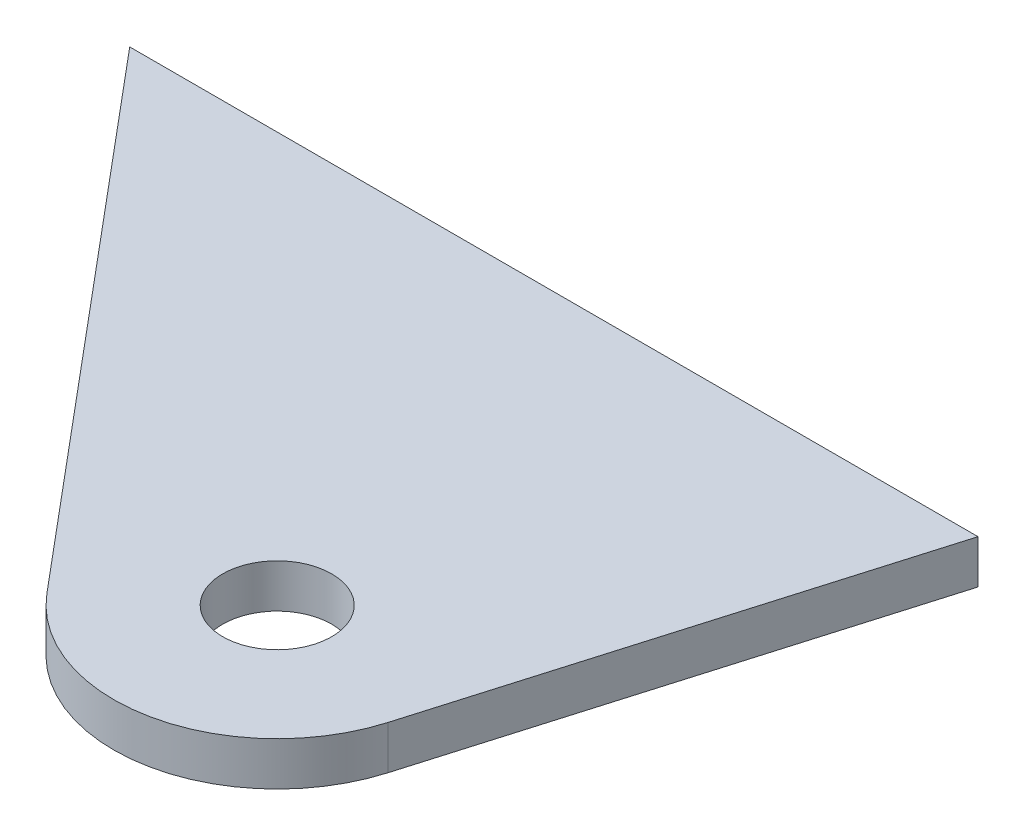
ISO-10303-21;
HEADER;
FILE_DESCRIPTION(('STEP AP214'),'2;1');
FILE_NAME('part.step','',(''),(''),'','','');
FILE_SCHEMA(('AUTOMOTIVE_DESIGN { 1 0 10303 214 1 1 1 1 }'));
ENDSEC;
DATA;
#1=APPLICATION_CONTEXT('core data for automotive mechanical design processes');
#2=APPLICATION_PROTOCOL_DEFINITION('international standard','automotive_design',2000,#1);
#3=PRODUCT_CONTEXT('',#1,'mechanical');
#4=PRODUCT('Part','Part','',(#3));
#5=PRODUCT_RELATED_PRODUCT_CATEGORY('part','',(#4));
#6=PRODUCT_DEFINITION_FORMATION('','',#4);
#7=PRODUCT_DEFINITION_CONTEXT('part definition',#1,'design');
#8=PRODUCT_DEFINITION('design','',#6,#7);
#9=PRODUCT_DEFINITION_SHAPE('','',#8);
#10=(LENGTH_UNIT() NAMED_UNIT(*) SI_UNIT(.MILLI.,.METRE.));
#11=(NAMED_UNIT(*) PLANE_ANGLE_UNIT() SI_UNIT($,.RADIAN.));
#12=(NAMED_UNIT(*) SI_UNIT($,.STERADIAN.) SOLID_ANGLE_UNIT());
#13=UNCERTAINTY_MEASURE_WITH_UNIT(LENGTH_MEASURE(1.E-05),#10,'distance_accuracy_value','');
#14=(GEOMETRIC_REPRESENTATION_CONTEXT(3) GLOBAL_UNCERTAINTY_ASSIGNED_CONTEXT((#13)) GLOBAL_UNIT_ASSIGNED_CONTEXT((#10,
#11,#12)) REPRESENTATION_CONTEXT('',''));
#15=CARTESIAN_POINT('',(0.,0.,0.));
#16=DIRECTION('',(0.,0.,1.));
#17=DIRECTION('',(1.,0.,0.));
#18=AXIS2_PLACEMENT_3D('',#15,#16,#17);
#19=CARTESIAN_POINT('',(101.6,128.27,193.675));
#20=DIRECTION('',(0.,-1.,0.));
#21=DIRECTION('',(0.,0.,-1.));
#22=AXIS2_PLACEMENT_3D('',#19,#20,#21);
#23=PLANE('',#22);
#24=DIRECTION('',(1.,0.,0.));
#25=VECTOR('',#24,1.);
#26=CARTESIAN_POINT('',(69.1316527751214,128.27,169.799));
#27=LINE('',#26,#25);
#28=CARTESIAN_POINT('',(69.1316527751214,128.27,169.799));
#29=VERTEX_POINT('',#28);
#30=CARTESIAN_POINT('',(118.552505653574,128.27,169.799));
#31=VERTEX_POINT('',#30);
#32=EDGE_CURVE('E86',#29,#31,#27,.T.);
#33=ORIENTED_EDGE('',*,*,#32,.T.);
#34=DIRECTION('',(-0.282223350691621,0.,0.959348727170884));
#35=VECTOR('',#34,1.);
#36=CARTESIAN_POINT('',(118.552505653574,128.27,169.799));
#37=LINE('',#36,#35);
#38=CARTESIAN_POINT('',(110.737796626303,128.27,196.363177415338));
#39=VERTEX_POINT('',#38);
#40=EDGE_CURVE('E81',#31,#39,#37,.T.);
#41=ORIENTED_EDGE('',*,*,#40,.T.);
#42=CARTESIAN_POINT('',(101.6,128.27,193.675));
#43=DIRECTION('',(0.,-1.,0.));
#44=DIRECTION('',(0.,0.,-1.));
#45=AXIS2_PLACEMENT_3D('',#42,#43,#44);
#46=CIRCLE('',#45,9.52499999999998);
#47=CARTESIAN_POINT('',(94.3034266792917,128.27,199.797551982264));
#48=VERTEX_POINT('',#47);
#49=EDGE_CURVE('E84',#39,#48,#46,.T.);
#50=ORIENTED_EDGE('',*,*,#49,.T.);
#51=DIRECTION('',(-0.642787609686538,0.,-0.76604444311898));
#52=VECTOR('',#51,1.);
#53=CARTESIAN_POINT('',(69.1316527751214,128.27,169.799));
#54=LINE('',#53,#52);
#55=EDGE_CURVE('E51',#48,#29,#54,.T.);
#56=ORIENTED_EDGE('',*,*,#55,.T.);
#57=EDGE_LOOP('',(#33,#41,#50,#56));
#58=FACE_BOUND('',#57,.T.);
#59=CARTESIAN_POINT('',(101.6,128.27,193.675));
#60=DIRECTION('',(0.,-1.,0.));
#61=DIRECTION('',(0.,0.,-1.));
#62=AXIS2_PLACEMENT_3D('',#59,#60,#61);
#63=CIRCLE('',#62,3.175);
#64=CARTESIAN_POINT('',(101.6,128.27,190.5));
#65=VERTEX_POINT('',#64);
#66=EDGE_CURVE('E101',#65,#65,#63,.T.);
#67=ORIENTED_EDGE('',*,*,#66,.F.);
#68=EDGE_LOOP('',(#67));
#69=FACE_BOUND('',#68,.T.);
#70=ADVANCED_FACE('F34',(#58,#69),#23,.T.);
#71=CARTESIAN_POINT('',(101.6,130.81,193.675));
#72=DIRECTION('',(0.,-1.,0.));
#73=DIRECTION('',(0.,0.,-1.));
#74=AXIS2_PLACEMENT_3D('',#71,#72,#73);
#75=PLANE('',#74);
#76=DIRECTION('',(1.,0.,0.));
#77=VECTOR('',#76,1.);
#78=CARTESIAN_POINT('',(69.1316527751214,130.81,169.799));
#79=LINE('',#78,#77);
#80=CARTESIAN_POINT('',(69.1316527751214,130.81,169.799));
#81=VERTEX_POINT('',#80);
#82=CARTESIAN_POINT('',(118.552505653574,130.81,169.799));
#83=VERTEX_POINT('',#82);
#84=EDGE_CURVE('E98',#81,#83,#79,.T.);
#85=ORIENTED_EDGE('',*,*,#84,.F.);
#86=DIRECTION('',(-0.642787609686538,0.,-0.76604444311898));
#87=VECTOR('',#86,1.);
#88=CARTESIAN_POINT('',(69.1316527751214,130.81,169.799));
#89=LINE('',#88,#87);
#90=CARTESIAN_POINT('',(94.3034266792917,130.81,199.797551982264));
#91=VERTEX_POINT('',#90);
#92=EDGE_CURVE('E74',#91,#81,#89,.T.);
#93=ORIENTED_EDGE('',*,*,#92,.F.);
#94=CARTESIAN_POINT('',(101.6,130.81,193.675));
#95=DIRECTION('',(0.,-1.,0.));
#96=DIRECTION('',(0.,0.,-1.));
#97=AXIS2_PLACEMENT_3D('',#94,#95,#96);
#98=CIRCLE('',#97,9.52499999999998);
#99=CARTESIAN_POINT('',(110.737796626303,130.81,196.363177415338));
#100=VERTEX_POINT('',#99);
#101=EDGE_CURVE('E68',#100,#91,#98,.T.);
#102=ORIENTED_EDGE('',*,*,#101,.F.);
#103=DIRECTION('',(-0.282223350691621,0.,0.959348727170884));
#104=VECTOR('',#103,1.);
#105=CARTESIAN_POINT('',(118.552505653574,130.81,169.799));
#106=LINE('',#105,#104);
#107=EDGE_CURVE('E90',#83,#100,#106,.T.);
#108=ORIENTED_EDGE('',*,*,#107,.F.);
#109=EDGE_LOOP('',(#85,#93,#102,#108));
#110=FACE_BOUND('',#109,.T.);
#111=CARTESIAN_POINT('',(101.6,130.81,193.675));
#112=DIRECTION('',(0.,-1.,0.));
#113=DIRECTION('',(0.,0.,-1.));
#114=AXIS2_PLACEMENT_3D('',#111,#112,#113);
#115=CIRCLE('',#114,3.175);
#116=CARTESIAN_POINT('',(101.6,130.81,190.5));
#117=VERTEX_POINT('',#116);
#118=EDGE_CURVE('E113',#117,#117,#115,.T.);
#119=ORIENTED_EDGE('',*,*,#118,.T.);
#120=EDGE_LOOP('',(#119));
#121=FACE_BOUND('',#120,.T.);
#122=ADVANCED_FACE('F109',(#110,#121),#75,.F.);
#123=CARTESIAN_POINT('',(69.1316527751214,128.27,169.799));
#124=DIRECTION('',(0.,0.,1.));
#125=DIRECTION('',(0.,-1.,0.));
#126=AXIS2_PLACEMENT_3D('',#123,#124,#125);
#127=PLANE('',#126);
#128=ORIENTED_EDGE('',*,*,#84,.T.);
#129=DIRECTION('',(0.,1.,0.));
#130=VECTOR('',#129,1.);
#131=CARTESIAN_POINT('',(118.552505653574,128.27,169.799));
#132=LINE('',#131,#130);
#133=EDGE_CURVE('E11',#31,#83,#132,.T.);
#134=ORIENTED_EDGE('',*,*,#133,.F.);
#135=ORIENTED_EDGE('',*,*,#32,.F.);
#136=DIRECTION('',(0.,1.,0.));
#137=VECTOR('',#136,1.);
#138=CARTESIAN_POINT('',(69.1316527751214,128.27,169.799));
#139=LINE('',#138,#137);
#140=EDGE_CURVE('E94',#29,#81,#139,.T.);
#141=ORIENTED_EDGE('',*,*,#140,.T.);
#142=EDGE_LOOP('',(#128,#134,#135,#141));
#143=FACE_BOUND('',#142,.T.);
#144=ADVANCED_FACE('F36',(#143),#127,.F.);
#145=CARTESIAN_POINT('',(118.552505653574,128.27,169.799));
#146=DIRECTION('',(-0.959348727170884,0.,-0.282223350691621));
#147=DIRECTION('',(-0.282223350691621,0.,0.959348727170884));
#148=AXIS2_PLACEMENT_3D('',#145,#146,#147);
#149=PLANE('',#148);
#150=ORIENTED_EDGE('',*,*,#107,.T.);
#151=DIRECTION('',(0.,1.,0.));
#152=VECTOR('',#151,1.);
#153=CARTESIAN_POINT('',(110.737796626303,128.27,196.363177415338));
#154=LINE('',#153,#152);
#155=EDGE_CURVE('E43',#39,#100,#154,.T.);
#156=ORIENTED_EDGE('',*,*,#155,.F.);
#157=ORIENTED_EDGE('',*,*,#40,.F.);
#158=ORIENTED_EDGE('',*,*,#133,.T.);
#159=EDGE_LOOP('',(#150,#156,#157,#158));
#160=FACE_BOUND('',#159,.T.);
#161=ADVANCED_FACE('F89',(#160),#149,.F.);
#162=CARTESIAN_POINT('',(101.6,128.27,193.675));
#163=DIRECTION('',(0.,1.,0.));
#164=DIRECTION('',(0.,0.,1.));
#165=AXIS2_PLACEMENT_3D('',#162,#163,#164);
#166=CYLINDRICAL_SURFACE('',#165,9.52499999999998);
#167=ORIENTED_EDGE('',*,*,#101,.T.);
#168=DIRECTION('',(0.,1.,0.));
#169=VECTOR('',#168,1.);
#170=CARTESIAN_POINT('',(94.3034266792917,128.27,199.797551982264));
#171=LINE('',#170,#169);
#172=EDGE_CURVE('E91',#48,#91,#171,.T.);
#173=ORIENTED_EDGE('',*,*,#172,.F.);
#174=ORIENTED_EDGE('',*,*,#49,.F.);
#175=ORIENTED_EDGE('',*,*,#155,.T.);
#176=EDGE_LOOP('',(#167,#173,#174,#175));
#177=FACE_BOUND('',#176,.T.);
#178=ADVANCED_FACE('F92',(#177),#166,.T.);
#179=CARTESIAN_POINT('',(69.1316527751214,128.27,169.799));
#180=DIRECTION('',(0.76604444311898,0.,-0.642787609686538));
#181=DIRECTION('',(-0.642787609686538,0.,-0.76604444311898));
#182=AXIS2_PLACEMENT_3D('',#179,#180,#181);
#183=PLANE('',#182);
#184=ORIENTED_EDGE('',*,*,#92,.T.);
#185=ORIENTED_EDGE('',*,*,#140,.F.);
#186=ORIENTED_EDGE('',*,*,#55,.F.);
#187=ORIENTED_EDGE('',*,*,#172,.T.);
#188=EDGE_LOOP('',(#184,#185,#186,#187));
#189=FACE_BOUND('',#188,.T.);
#190=ADVANCED_FACE('F106',(#189),#183,.F.);
#191=CARTESIAN_POINT('',(101.6,128.27,193.675));
#192=DIRECTION('',(0.,1.,0.));
#193=DIRECTION('',(0.,0.,1.));
#194=AXIS2_PLACEMENT_3D('',#191,#192,#193);
#195=CYLINDRICAL_SURFACE('',#194,3.175);
#196=ORIENTED_EDGE('',*,*,#66,.T.);
#197=EDGE_LOOP('',(#196));
#198=FACE_BOUND('',#197,.T.);
#199=ORIENTED_EDGE('',*,*,#118,.F.);
#200=EDGE_LOOP('',(#199));
#201=FACE_BOUND('',#200,.T.);
#202=ADVANCED_FACE('F119',(#198,#201),#195,.F.);
#203=CLOSED_SHELL('',(#70,#122,#144,#161,#178,#190,#202));
#204=MANIFOLD_SOLID_BREP('B2',#203);
#205=ADVANCED_BREP_SHAPE_REPRESENTATION('',(#18,#204),#14);
#206=SHAPE_DEFINITION_REPRESENTATION(#9,#205);
ENDSEC;
END-ISO-10303-21;
